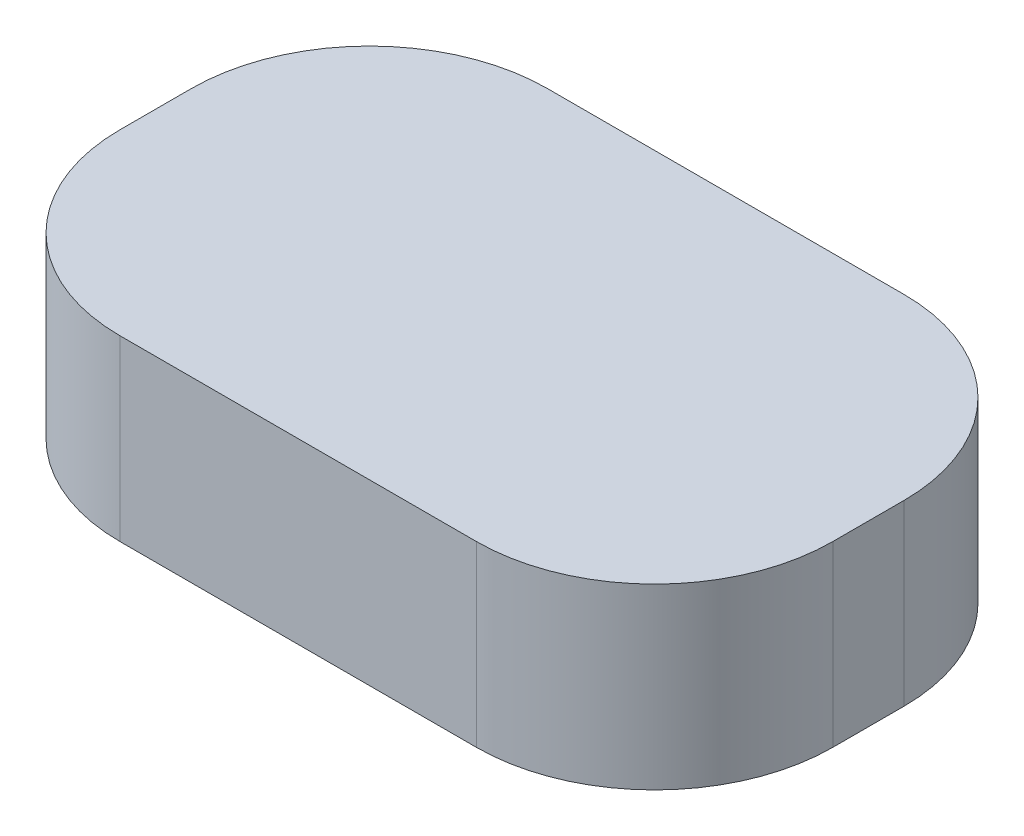
ISO-10303-21;
HEADER;
FILE_DESCRIPTION(('STEP AP214'),'2;1');
FILE_NAME('part.step','',(''),(''),'','','');
FILE_SCHEMA(('AUTOMOTIVE_DESIGN { 1 0 10303 214 1 1 1 1 }'));
ENDSEC;
DATA;
#1=APPLICATION_CONTEXT('core data for automotive mechanical design processes');
#2=APPLICATION_PROTOCOL_DEFINITION('international standard','automotive_design',2000,#1);
#3=PRODUCT_CONTEXT('',#1,'mechanical');
#4=PRODUCT('Part','Part','',(#3));
#5=PRODUCT_RELATED_PRODUCT_CATEGORY('part','',(#4));
#6=PRODUCT_DEFINITION_FORMATION('','',#4);
#7=PRODUCT_DEFINITION_CONTEXT('part definition',#1,'design');
#8=PRODUCT_DEFINITION('design','',#6,#7);
#9=PRODUCT_DEFINITION_SHAPE('','',#8);
#10=(LENGTH_UNIT() NAMED_UNIT(*) SI_UNIT(.MILLI.,.METRE.));
#11=(NAMED_UNIT(*) PLANE_ANGLE_UNIT() SI_UNIT($,.RADIAN.));
#12=(NAMED_UNIT(*) SI_UNIT($,.STERADIAN.) SOLID_ANGLE_UNIT());
#13=UNCERTAINTY_MEASURE_WITH_UNIT(LENGTH_MEASURE(1.E-05),#10,'distance_accuracy_value','');
#14=(GEOMETRIC_REPRESENTATION_CONTEXT(3) GLOBAL_UNCERTAINTY_ASSIGNED_CONTEXT((#13)) GLOBAL_UNIT_ASSIGNED_CONTEXT((#10,
#11,#12)) REPRESENTATION_CONTEXT('',''));
#15=CARTESIAN_POINT('',(0.,0.,0.));
#16=DIRECTION('',(0.,0.,1.));
#17=DIRECTION('',(1.,0.,0.));
#18=AXIS2_PLACEMENT_3D('',#15,#16,#17);
#19=CARTESIAN_POINT('',(15.,5.,7.));
#20=DIRECTION('',(0.,-1.,0.));
#21=DIRECTION('',(0.,0.,-1.));
#22=AXIS2_PLACEMENT_3D('',#19,#20,#21);
#23=CYLINDRICAL_SURFACE('',#22,5.);
#24=CARTESIAN_POINT('',(15.,0.,7.));
#25=DIRECTION('',(0.,1.,0.));
#26=DIRECTION('',(0.,0.,1.));
#27=AXIS2_PLACEMENT_3D('',#24,#25,#26);
#28=CIRCLE('',#27,5.);
#29=CARTESIAN_POINT('',(15.,0.,12.));
#30=VERTEX_POINT('',#29);
#31=CARTESIAN_POINT('',(20.,0.,7.));
#32=VERTEX_POINT('',#31);
#33=EDGE_CURVE('E129',#30,#32,#28,.T.);
#34=ORIENTED_EDGE('',*,*,#33,.T.);
#35=DIRECTION('',(0.,-1.,0.));
#36=VECTOR('',#35,1.);
#37=CARTESIAN_POINT('',(20.,5.,7.));
#38=LINE('',#37,#36);
#39=CARTESIAN_POINT('',(20.,5.,7.));
#40=VERTEX_POINT('',#39);
#41=EDGE_CURVE('E11',#40,#32,#38,.T.);
#42=ORIENTED_EDGE('',*,*,#41,.F.);
#43=CARTESIAN_POINT('',(15.,5.,7.));
#44=DIRECTION('',(0.,1.,0.));
#45=DIRECTION('',(0.,0.,1.));
#46=AXIS2_PLACEMENT_3D('',#43,#44,#45);
#47=CIRCLE('',#46,5.);
#48=CARTESIAN_POINT('',(15.,5.,12.));
#49=VERTEX_POINT('',#48);
#50=EDGE_CURVE('E143',#49,#40,#47,.T.);
#51=ORIENTED_EDGE('',*,*,#50,.F.);
#52=DIRECTION('',(0.,-1.,0.));
#53=VECTOR('',#52,1.);
#54=CARTESIAN_POINT('',(15.,5.,12.));
#55=LINE('',#54,#53);
#56=EDGE_CURVE('E125',#49,#30,#55,.T.);
#57=ORIENTED_EDGE('',*,*,#56,.T.);
#58=EDGE_LOOP('',(#34,#42,#51,#57));
#59=FACE_BOUND('',#58,.T.);
#60=ADVANCED_FACE('F33',(#59),#23,.T.);
#61=CARTESIAN_POINT('',(20.,5.,5.));
#62=DIRECTION('',(-1.,0.,0.));
#63=DIRECTION('',(0.,0.,1.));
#64=AXIS2_PLACEMENT_3D('',#61,#62,#63);
#65=PLANE('',#64);
#66=DIRECTION('',(0.,0.,-1.));
#67=VECTOR('',#66,1.);
#68=CARTESIAN_POINT('',(20.,0.,5.));
#69=LINE('',#68,#67);
#70=CARTESIAN_POINT('',(20.,0.,5.));
#71=VERTEX_POINT('',#70);
#72=EDGE_CURVE('E132',#32,#71,#69,.T.);
#73=ORIENTED_EDGE('',*,*,#72,.T.);
#74=DIRECTION('',(0.,-1.,0.));
#75=VECTOR('',#74,1.);
#76=CARTESIAN_POINT('',(20.,5.,5.));
#77=LINE('',#76,#75);
#78=CARTESIAN_POINT('',(20.,5.,5.));
#79=VERTEX_POINT('',#78);
#80=EDGE_CURVE('E41',#79,#71,#77,.T.);
#81=ORIENTED_EDGE('',*,*,#80,.F.);
#82=DIRECTION('',(0.,0.,-1.));
#83=VECTOR('',#82,1.);
#84=CARTESIAN_POINT('',(20.,5.,5.));
#85=LINE('',#84,#83);
#86=EDGE_CURVE('E92',#40,#79,#85,.T.);
#87=ORIENTED_EDGE('',*,*,#86,.F.);
#88=ORIENTED_EDGE('',*,*,#41,.T.);
#89=EDGE_LOOP('',(#73,#81,#87,#88));
#90=FACE_BOUND('',#89,.T.);
#91=ADVANCED_FACE('F178',(#90),#65,.F.);
#92=CARTESIAN_POINT('',(15.,5.,5.));
#93=DIRECTION('',(0.,-1.,0.));
#94=DIRECTION('',(0.,0.,-1.));
#95=AXIS2_PLACEMENT_3D('',#92,#93,#94);
#96=CYLINDRICAL_SURFACE('',#95,5.);
#97=CARTESIAN_POINT('',(15.,0.,5.));
#98=DIRECTION('',(0.,1.,0.));
#99=DIRECTION('',(0.,0.,1.));
#100=AXIS2_PLACEMENT_3D('',#97,#98,#99);
#101=CIRCLE('',#100,5.);
#102=CARTESIAN_POINT('',(15.,0.,0.));
#103=VERTEX_POINT('',#102);
#104=EDGE_CURVE('E134',#71,#103,#101,.T.);
#105=ORIENTED_EDGE('',*,*,#104,.T.);
#106=DIRECTION('',(0.,-1.,0.));
#107=VECTOR('',#106,1.);
#108=CARTESIAN_POINT('',(15.,5.,0.));
#109=LINE('',#108,#107);
#110=CARTESIAN_POINT('',(15.,5.,0.));
#111=VERTEX_POINT('',#110);
#112=EDGE_CURVE('E150',#111,#103,#109,.T.);
#113=ORIENTED_EDGE('',*,*,#112,.F.);
#114=CARTESIAN_POINT('',(15.,5.,5.));
#115=DIRECTION('',(0.,1.,0.));
#116=DIRECTION('',(0.,0.,1.));
#117=AXIS2_PLACEMENT_3D('',#114,#115,#116);
#118=CIRCLE('',#117,5.);
#119=EDGE_CURVE('E158',#79,#111,#118,.T.);
#120=ORIENTED_EDGE('',*,*,#119,.F.);
#121=ORIENTED_EDGE('',*,*,#80,.T.);
#122=EDGE_LOOP('',(#105,#113,#120,#121));
#123=FACE_BOUND('',#122,.T.);
#124=ADVANCED_FACE('F156',(#123),#96,.T.);
#125=CARTESIAN_POINT('',(5.00000000000004,5.,0.));
#126=DIRECTION('',(0.,0.,1.));
#127=DIRECTION('',(1.,0.,0.));
#128=AXIS2_PLACEMENT_3D('',#125,#126,#127);
#129=PLANE('',#128);
#130=DIRECTION('',(-1.,0.,0.));
#131=VECTOR('',#130,1.);
#132=CARTESIAN_POINT('',(5.00000000000004,0.,0.));
#133=LINE('',#132,#131);
#134=CARTESIAN_POINT('',(5.,0.,0.));
#135=VERTEX_POINT('',#134);
#136=EDGE_CURVE('E136',#103,#135,#133,.T.);
#137=ORIENTED_EDGE('',*,*,#136,.T.);
#138=DIRECTION('',(0.,-1.,0.));
#139=VECTOR('',#138,1.);
#140=CARTESIAN_POINT('',(5.,5.,0.));
#141=LINE('',#140,#139);
#142=CARTESIAN_POINT('',(5.,5.,0.));
#143=VERTEX_POINT('',#142);
#144=EDGE_CURVE('E147',#143,#135,#141,.T.);
#145=ORIENTED_EDGE('',*,*,#144,.F.);
#146=DIRECTION('',(-1.,0.,0.));
#147=VECTOR('',#146,1.);
#148=CARTESIAN_POINT('',(5.00000000000004,5.,0.));
#149=LINE('',#148,#147);
#150=EDGE_CURVE('E170',#111,#143,#149,.T.);
#151=ORIENTED_EDGE('',*,*,#150,.F.);
#152=ORIENTED_EDGE('',*,*,#112,.T.);
#153=EDGE_LOOP('',(#137,#145,#151,#152));
#154=FACE_BOUND('',#153,.T.);
#155=ADVANCED_FACE('F166',(#154),#129,.F.);
#156=CARTESIAN_POINT('',(5.,5.,5.));
#157=DIRECTION('',(0.,-1.,0.));
#158=DIRECTION('',(0.,0.,-1.));
#159=AXIS2_PLACEMENT_3D('',#156,#157,#158);
#160=CYLINDRICAL_SURFACE('',#159,5.);
#161=CARTESIAN_POINT('',(5.,0.,5.));
#162=DIRECTION('',(0.,1.,0.));
#163=DIRECTION('',(0.,0.,-1.));
#164=AXIS2_PLACEMENT_3D('',#161,#162,#163);
#165=CIRCLE('',#164,5.);
#166=CARTESIAN_POINT('',(0.,0.,5.00000000000004));
#167=VERTEX_POINT('',#166);
#168=EDGE_CURVE('E138',#135,#167,#165,.T.);
#169=ORIENTED_EDGE('',*,*,#168,.T.);
#170=DIRECTION('',(0.,-1.,0.));
#171=VECTOR('',#170,1.);
#172=CARTESIAN_POINT('',(0.,5.,5.00000000000004));
#173=LINE('',#172,#171);
#174=CARTESIAN_POINT('',(0.,5.,5.00000000000004));
#175=VERTEX_POINT('',#174);
#176=EDGE_CURVE('E120',#175,#167,#173,.T.);
#177=ORIENTED_EDGE('',*,*,#176,.F.);
#178=CARTESIAN_POINT('',(5.,5.,5.));
#179=DIRECTION('',(0.,1.,0.));
#180=DIRECTION('',(0.,0.,-1.));
#181=AXIS2_PLACEMENT_3D('',#178,#179,#180);
#182=CIRCLE('',#181,5.);
#183=EDGE_CURVE('E111',#143,#175,#182,.T.);
#184=ORIENTED_EDGE('',*,*,#183,.F.);
#185=ORIENTED_EDGE('',*,*,#144,.T.);
#186=EDGE_LOOP('',(#169,#177,#184,#185));
#187=FACE_BOUND('',#186,.T.);
#188=ADVANCED_FACE('F169',(#187),#160,.T.);
#189=CARTESIAN_POINT('',(0.,5.,5.00000000000004));
#190=DIRECTION('',(1.,0.,0.));
#191=DIRECTION('',(0.,0.,-1.));
#192=AXIS2_PLACEMENT_3D('',#189,#190,#191);
#193=PLANE('',#192);
#194=DIRECTION('',(0.,0.,1.));
#195=VECTOR('',#194,1.);
#196=CARTESIAN_POINT('',(0.,0.,5.00000000000004));
#197=LINE('',#196,#195);
#198=CARTESIAN_POINT('',(0.,0.,7.));
#199=VERTEX_POINT('',#198);
#200=EDGE_CURVE('E119',#167,#199,#197,.T.);
#201=ORIENTED_EDGE('',*,*,#200,.T.);
#202=DIRECTION('',(0.,-1.,0.));
#203=VECTOR('',#202,1.);
#204=CARTESIAN_POINT('',(0.,5.,7.));
#205=LINE('',#204,#203);
#206=CARTESIAN_POINT('',(0.,5.,7.));
#207=VERTEX_POINT('',#206);
#208=EDGE_CURVE('E116',#207,#199,#205,.T.);
#209=ORIENTED_EDGE('',*,*,#208,.F.);
#210=DIRECTION('',(0.,0.,1.));
#211=VECTOR('',#210,1.);
#212=CARTESIAN_POINT('',(0.,5.,5.00000000000004));
#213=LINE('',#212,#211);
#214=EDGE_CURVE('E105',#175,#207,#213,.T.);
#215=ORIENTED_EDGE('',*,*,#214,.F.);
#216=ORIENTED_EDGE('',*,*,#176,.T.);
#217=EDGE_LOOP('',(#201,#209,#215,#216));
#218=FACE_BOUND('',#217,.T.);
#219=ADVANCED_FACE('F117',(#218),#193,.F.);
#220=CARTESIAN_POINT('',(5.,5.,7.));
#221=DIRECTION('',(0.,-1.,0.));
#222=DIRECTION('',(0.,0.,-1.));
#223=AXIS2_PLACEMENT_3D('',#220,#221,#222);
#224=CYLINDRICAL_SURFACE('',#223,5.);
#225=CARTESIAN_POINT('',(5.,0.,7.));
#226=DIRECTION('',(0.,1.,0.));
#227=DIRECTION('',(0.,0.,-1.));
#228=AXIS2_PLACEMENT_3D('',#225,#226,#227);
#229=CIRCLE('',#228,5.);
#230=CARTESIAN_POINT('',(5.,0.,12.));
#231=VERTEX_POINT('',#230);
#232=EDGE_CURVE('E78',#199,#231,#229,.T.);
#233=ORIENTED_EDGE('',*,*,#232,.T.);
#234=DIRECTION('',(0.,-1.,0.));
#235=VECTOR('',#234,1.);
#236=CARTESIAN_POINT('',(5.,5.,12.));
#237=LINE('',#236,#235);
#238=CARTESIAN_POINT('',(5.,5.,12.));
#239=VERTEX_POINT('',#238);
#240=EDGE_CURVE('E121',#239,#231,#237,.T.);
#241=ORIENTED_EDGE('',*,*,#240,.F.);
#242=CARTESIAN_POINT('',(5.,5.,7.));
#243=DIRECTION('',(0.,1.,0.));
#244=DIRECTION('',(0.,0.,-1.));
#245=AXIS2_PLACEMENT_3D('',#242,#243,#244);
#246=CIRCLE('',#245,5.);
#247=EDGE_CURVE('E109',#207,#239,#246,.T.);
#248=ORIENTED_EDGE('',*,*,#247,.F.);
#249=ORIENTED_EDGE('',*,*,#208,.T.);
#250=EDGE_LOOP('',(#233,#241,#248,#249));
#251=FACE_BOUND('',#250,.T.);
#252=ADVANCED_FACE('F123',(#251),#224,.T.);
#253=CARTESIAN_POINT('',(5.,5.,12.));
#254=DIRECTION('',(0.,0.,-1.));
#255=DIRECTION('',(-1.,0.,0.));
#256=AXIS2_PLACEMENT_3D('',#253,#254,#255);
#257=PLANE('',#256);
#258=DIRECTION('',(1.,0.,0.));
#259=VECTOR('',#258,1.);
#260=CARTESIAN_POINT('',(5.,0.,12.));
#261=LINE('',#260,#259);
#262=EDGE_CURVE('E84',#231,#30,#261,.T.);
#263=ORIENTED_EDGE('',*,*,#262,.T.);
#264=ORIENTED_EDGE('',*,*,#56,.F.);
#265=DIRECTION('',(1.,0.,0.));
#266=VECTOR('',#265,1.);
#267=CARTESIAN_POINT('',(5.,5.,12.));
#268=LINE('',#267,#266);
#269=EDGE_CURVE('E49',#239,#49,#268,.T.);
#270=ORIENTED_EDGE('',*,*,#269,.F.);
#271=ORIENTED_EDGE('',*,*,#240,.T.);
#272=EDGE_LOOP('',(#263,#264,#270,#271));
#273=FACE_BOUND('',#272,.T.);
#274=ADVANCED_FACE('F194',(#273),#257,.F.);
#275=CARTESIAN_POINT('',(15.,5.,7.));
#276=DIRECTION('',(0.,1.,0.));
#277=DIRECTION('',(0.,0.,1.));
#278=AXIS2_PLACEMENT_3D('',#275,#276,#277);
#279=PLANE('',#278);
#280=ORIENTED_EDGE('',*,*,#50,.T.);
#281=ORIENTED_EDGE('',*,*,#86,.T.);
#282=ORIENTED_EDGE('',*,*,#119,.T.);
#283=ORIENTED_EDGE('',*,*,#150,.T.);
#284=ORIENTED_EDGE('',*,*,#183,.T.);
#285=ORIENTED_EDGE('',*,*,#214,.T.);
#286=ORIENTED_EDGE('',*,*,#247,.T.);
#287=ORIENTED_EDGE('',*,*,#269,.T.);
#288=EDGE_LOOP('',(#280,#281,#282,#283,#284,#285,#286,#287));
#289=FACE_BOUND('',#288,.T.);
#290=ADVANCED_FACE('F107',(#289),#279,.T.);
#291=CARTESIAN_POINT('',(15.,0.,7.));
#292=DIRECTION('',(0.,1.,0.));
#293=DIRECTION('',(0.,0.,1.));
#294=AXIS2_PLACEMENT_3D('',#291,#292,#293);
#295=PLANE('',#294);
#296=ORIENTED_EDGE('',*,*,#33,.F.);
#297=ORIENTED_EDGE('',*,*,#262,.F.);
#298=ORIENTED_EDGE('',*,*,#232,.F.);
#299=ORIENTED_EDGE('',*,*,#200,.F.);
#300=ORIENTED_EDGE('',*,*,#168,.F.);
#301=ORIENTED_EDGE('',*,*,#136,.F.);
#302=ORIENTED_EDGE('',*,*,#104,.F.);
#303=ORIENTED_EDGE('',*,*,#72,.F.);
#304=EDGE_LOOP('',(#296,#297,#298,#299,#300,#301,#302,#303));
#305=FACE_BOUND('',#304,.T.);
#306=ADVANCED_FACE('F162',(#305),#295,.F.);
#307=CLOSED_SHELL('',(#60,#91,#124,#155,#188,#219,#252,#274,#290,#306));
#308=MANIFOLD_SOLID_BREP('B2',#307);
#309=ADVANCED_BREP_SHAPE_REPRESENTATION('',(#18,#308),#14);
#310=SHAPE_DEFINITION_REPRESENTATION(#9,#309);
ENDSEC;
END-ISO-10303-21;
